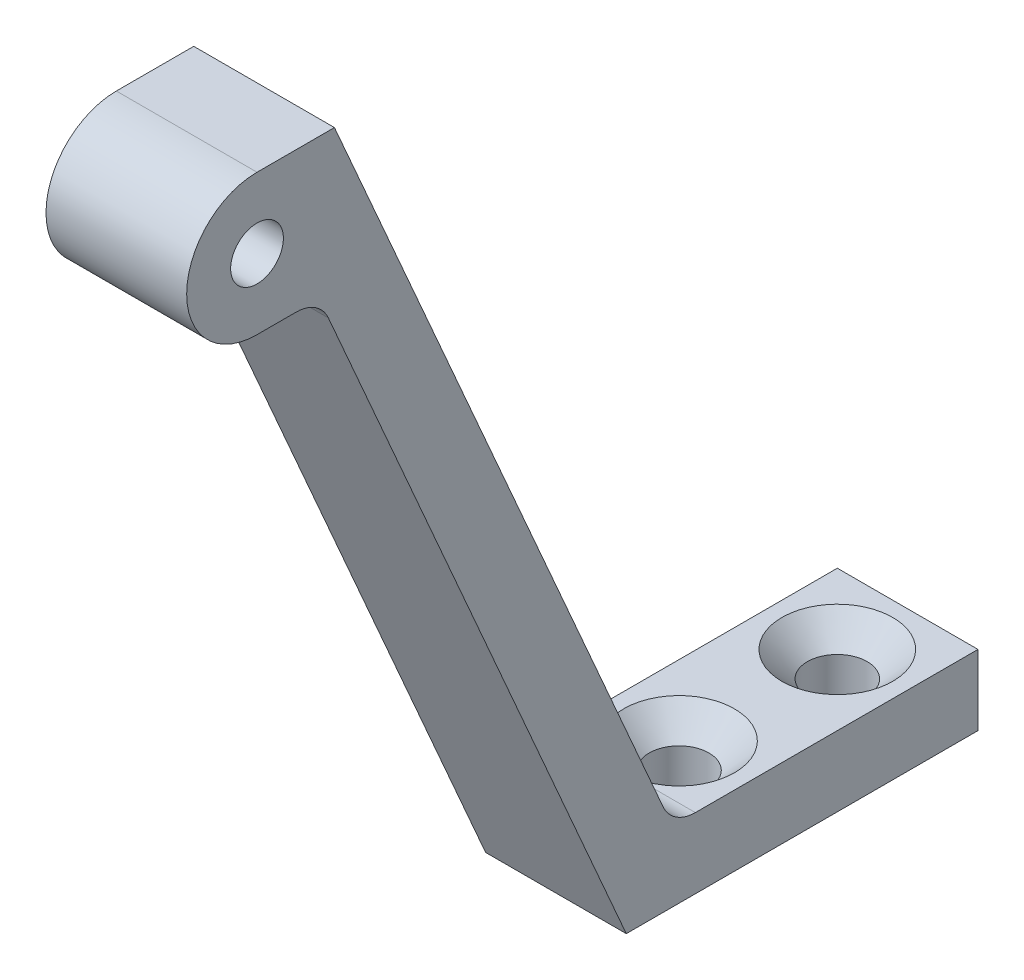
ISO-10303-21;
HEADER;
FILE_DESCRIPTION(('STEP AP214'),'2;1');
FILE_NAME('part.step','',(''),(''),'','','');
FILE_SCHEMA(('AUTOMOTIVE_DESIGN { 1 0 10303 214 1 1 1 1 }'));
ENDSEC;
DATA;
#1=APPLICATION_CONTEXT('core data for automotive mechanical design processes');
#2=APPLICATION_PROTOCOL_DEFINITION('international standard','automotive_design',2000,#1);
#3=PRODUCT_CONTEXT('',#1,'mechanical');
#4=PRODUCT('Part','Part','',(#3));
#5=PRODUCT_RELATED_PRODUCT_CATEGORY('part','',(#4));
#6=PRODUCT_DEFINITION_FORMATION('','',#4);
#7=PRODUCT_DEFINITION_CONTEXT('part definition',#1,'design');
#8=PRODUCT_DEFINITION('design','',#6,#7);
#9=PRODUCT_DEFINITION_SHAPE('','',#8);
#10=(LENGTH_UNIT() NAMED_UNIT(*) SI_UNIT(.MILLI.,.METRE.));
#11=(NAMED_UNIT(*) PLANE_ANGLE_UNIT() SI_UNIT($,.RADIAN.));
#12=(NAMED_UNIT(*) SI_UNIT($,.STERADIAN.) SOLID_ANGLE_UNIT());
#13=UNCERTAINTY_MEASURE_WITH_UNIT(LENGTH_MEASURE(1.E-05),#10,'distance_accuracy_value','');
#14=(GEOMETRIC_REPRESENTATION_CONTEXT(3) GLOBAL_UNCERTAINTY_ASSIGNED_CONTEXT((#13)) GLOBAL_UNIT_ASSIGNED_CONTEXT((#10,
#11,#12)) REPRESENTATION_CONTEXT('',''));
#15=CARTESIAN_POINT('',(0.,0.,0.));
#16=DIRECTION('',(0.,0.,1.));
#17=DIRECTION('',(1.,0.,0.));
#18=AXIS2_PLACEMENT_3D('',#15,#16,#17);
#19=CARTESIAN_POINT('',(4.,47.1171566627201,0.));
#20=DIRECTION('',(0.,-1.,0.));
#21=DIRECTION('',(0.,0.,-1.));
#22=AXIS2_PLACEMENT_3D('',#19,#20,#21);
#23=PLANE('',#22);
#24=DIRECTION('',(0.,0.,1.));
#25=VECTOR('',#24,1.);
#26=CARTESIAN_POINT('',(-4.,47.1171566627201,0.));
#27=LINE('',#26,#25);
#28=CARTESIAN_POINT('',(-4.,47.1171566627202,36.5978842547107));
#29=VERTEX_POINT('',#28);
#30=CARTESIAN_POINT('',(-4.,47.1171566627202,41.));
#31=VERTEX_POINT('',#30);
#32=EDGE_CURVE('E160',#29,#31,#27,.T.);
#33=ORIENTED_EDGE('',*,*,#32,.T.);
#34=DIRECTION('',(-1.,0.,0.));
#35=VECTOR('',#34,1.);
#36=CARTESIAN_POINT('',(4.,47.1171566627202,41.));
#37=LINE('',#36,#35);
#38=CARTESIAN_POINT('',(4.,47.1171566627202,41.));
#39=VERTEX_POINT('',#38);
#40=EDGE_CURVE('E140',#39,#31,#37,.T.);
#41=ORIENTED_EDGE('',*,*,#40,.F.);
#42=DIRECTION('',(0.,0.,1.));
#43=VECTOR('',#42,1.);
#44=CARTESIAN_POINT('',(4.,47.1171566627201,0.));
#45=LINE('',#44,#43);
#46=CARTESIAN_POINT('',(4.,47.1171566627202,36.5978842547107));
#47=VERTEX_POINT('',#46);
#48=EDGE_CURVE('E148',#47,#39,#45,.T.);
#49=ORIENTED_EDGE('',*,*,#48,.F.);
#50=DIRECTION('',(-1.,0.,0.));
#51=VECTOR('',#50,1.);
#52=CARTESIAN_POINT('',(4.,47.1171566627202,36.5978842547107));
#53=LINE('',#52,#51);
#54=EDGE_CURVE('E255',#47,#29,#53,.T.);
#55=ORIENTED_EDGE('',*,*,#54,.T.);
#56=EDGE_LOOP('',(#33,#41,#49,#55));
#57=FACE_BOUND('',#56,.T.);
#58=ADVANCED_FACE('F39',(#57),#23,.F.);
#59=CARTESIAN_POINT('',(4.,43.1171566627202,41.));
#60=DIRECTION('',(-1.,0.,0.));
#61=DIRECTION('',(0.,0.,1.));
#62=AXIS2_PLACEMENT_3D('',#59,#60,#61);
#63=CYLINDRICAL_SURFACE('',#62,4.);
#64=CARTESIAN_POINT('',(-4.,43.1171566627202,41.));
#65=DIRECTION('',(1.,0.,0.));
#66=DIRECTION('',(0.,0.,-1.));
#67=AXIS2_PLACEMENT_3D('',#64,#65,#66);
#68=CIRCLE('',#67,4.);
#69=CARTESIAN_POINT('',(-4.,39.1171566627202,41.));
#70=VERTEX_POINT('',#69);
#71=EDGE_CURVE('E282',#31,#70,#68,.T.);
#72=ORIENTED_EDGE('',*,*,#71,.T.);
#73=DIRECTION('',(-1.,0.,0.));
#74=VECTOR('',#73,1.);
#75=CARTESIAN_POINT('',(4.,39.1171566627202,41.));
#76=LINE('',#75,#74);
#77=CARTESIAN_POINT('',(4.,39.1171566627202,41.));
#78=VERTEX_POINT('',#77);
#79=EDGE_CURVE('E143',#78,#70,#76,.T.);
#80=ORIENTED_EDGE('',*,*,#79,.F.);
#81=CARTESIAN_POINT('',(4.,43.1171566627202,41.));
#82=DIRECTION('',(1.,0.,0.));
#83=DIRECTION('',(0.,0.,-1.));
#84=AXIS2_PLACEMENT_3D('',#81,#82,#83);
#85=CIRCLE('',#84,4.);
#86=EDGE_CURVE('E136',#39,#78,#85,.T.);
#87=ORIENTED_EDGE('',*,*,#86,.F.);
#88=ORIENTED_EDGE('',*,*,#40,.T.);
#89=EDGE_LOOP('',(#72,#80,#87,#88));
#90=FACE_BOUND('',#89,.T.);
#91=ADVANCED_FACE('F138',(#90),#63,.T.);
#92=CARTESIAN_POINT('',(4.,39.1171566627202,0.));
#93=DIRECTION('',(0.,1.,0.));
#94=DIRECTION('',(0.,0.,1.));
#95=AXIS2_PLACEMENT_3D('',#92,#93,#94);
#96=PLANE('',#95);
#97=DIRECTION('',(0.,0.,-1.));
#98=VECTOR('',#97,1.);
#99=CARTESIAN_POINT('',(-4.,39.1171566627202,0.));
#100=LINE('',#99,#98);
#101=CARTESIAN_POINT('',(-4.,39.1171566627202,38.777880849664));
#102=VERTEX_POINT('',#101);
#103=EDGE_CURVE('E277',#70,#102,#100,.T.);
#104=ORIENTED_EDGE('',*,*,#103,.T.);
#105=DIRECTION('',(-1.,0.,0.));
#106=VECTOR('',#105,1.);
#107=CARTESIAN_POINT('',(4.,39.1171566627202,38.777880849664));
#108=LINE('',#107,#106);
#109=CARTESIAN_POINT('',(4.,39.1171566627202,38.777880849664));
#110=VERTEX_POINT('',#109);
#111=EDGE_CURVE('E164',#102,#110,#108,.F.);
#112=ORIENTED_EDGE('',*,*,#111,.T.);
#113=DIRECTION('',(0.,0.,-1.));
#114=VECTOR('',#113,1.);
#115=CARTESIAN_POINT('',(4.,39.1171566627202,0.));
#116=LINE('',#115,#114);
#117=EDGE_CURVE('E147',#78,#110,#116,.T.);
#118=ORIENTED_EDGE('',*,*,#117,.F.);
#119=ORIENTED_EDGE('',*,*,#79,.T.);
#120=EDGE_LOOP('',(#104,#112,#118,#119));
#121=FACE_BOUND('',#120,.T.);
#122=ADVANCED_FACE('F317',(#121),#96,.F.);
#123=CARTESIAN_POINT('',(4.,-7.47681165129679,17.1202626975046));
#124=DIRECTION('',(0.,0.400221050026293,-0.916418633112537));
#125=DIRECTION('',(0.,0.916418633112537,0.400221050026293));
#126=AXIS2_PLACEMENT_3D('',#123,#124,#125);
#127=PLANE('',#126);
#128=DIRECTION('',(0.,-0.916418633112537,-0.400221050026293));
#129=VECTOR('',#128,1.);
#130=CARTESIAN_POINT('',(4.,-7.47681165129679,17.1202626975046));
#131=LINE('',#130,#129);
#132=CARTESIAN_POINT('',(4.,37.9175987627727,36.9450435834389));
#133=VERTEX_POINT('',#132);
#134=CARTESIAN_POINT('',(4.,-0.882843337279837,20.));
#135=VERTEX_POINT('',#134);
#136=EDGE_CURVE('E293',#133,#135,#131,.T.);
#137=ORIENTED_EDGE('',*,*,#136,.F.);
#138=DIRECTION('',(-1.,0.,0.));
#139=VECTOR('',#138,1.);
#140=CARTESIAN_POINT('',(-4.,37.9175987627727,36.9450435834389));
#141=LINE('',#140,#139);
#142=CARTESIAN_POINT('',(-4.,37.9175987627727,36.9450435834389));
#143=VERTEX_POINT('',#142);
#144=EDGE_CURVE('E161',#133,#143,#141,.T.);
#145=ORIENTED_EDGE('',*,*,#144,.T.);
#146=DIRECTION('',(0.,-0.916418633112537,-0.400221050026293));
#147=VECTOR('',#146,1.);
#148=CARTESIAN_POINT('',(-4.,-7.47681165129679,17.1202626975046));
#149=LINE('',#148,#147);
#150=CARTESIAN_POINT('',(-4.,-0.882843337279837,20.));
#151=VERTEX_POINT('',#150);
#152=EDGE_CURVE('E275',#143,#151,#149,.T.);
#153=ORIENTED_EDGE('',*,*,#152,.T.);
#154=DIRECTION('',(-1.,0.,0.));
#155=VECTOR('',#154,1.);
#156=CARTESIAN_POINT('',(4.,-0.882843337279837,20.));
#157=LINE('',#156,#155);
#158=EDGE_CURVE('E166',#135,#151,#157,.T.);
#159=ORIENTED_EDGE('',*,*,#158,.F.);
#160=EDGE_LOOP('',(#137,#145,#153,#159));
#161=FACE_BOUND('',#160,.T.);
#162=ADVANCED_FACE('F312',(#161),#127,.F.);
#163=CARTESIAN_POINT('',(4.,-0.882843337279837,0.));
#164=DIRECTION('',(0.,1.,0.));
#165=DIRECTION('',(0.,0.,1.));
#166=AXIS2_PLACEMENT_3D('',#163,#164,#165);
#167=PLANE('',#166);
#168=CARTESIAN_POINT('',(0.,-0.882843337279837,13.));
#169=DIRECTION('',(0.,1.,0.));
#170=DIRECTION('',(0.,0.,1.));
#171=AXIS2_PLACEMENT_3D('',#168,#169,#170);
#172=CIRCLE('',#171,1.7);
#173=CARTESIAN_POINT('',(0.,-0.882843337279837,14.7));
#174=VERTEX_POINT('',#173);
#175=EDGE_CURVE('E175',#174,#174,#172,.T.);
#176=ORIENTED_EDGE('',*,*,#175,.T.);
#177=EDGE_LOOP('',(#176));
#178=FACE_BOUND('',#177,.T.);
#179=CARTESIAN_POINT('',(0.,-0.882843337279838,4.));
#180=DIRECTION('',(0.,1.,0.));
#181=DIRECTION('',(0.,0.,1.));
#182=AXIS2_PLACEMENT_3D('',#179,#180,#181);
#183=CIRCLE('',#182,1.7);
#184=CARTESIAN_POINT('',(0.,-0.882843337279838,5.7));
#185=VERTEX_POINT('',#184);
#186=EDGE_CURVE('E170',#185,#185,#183,.T.);
#187=ORIENTED_EDGE('',*,*,#186,.T.);
#188=EDGE_LOOP('',(#187));
#189=FACE_BOUND('',#188,.T.);
#190=DIRECTION('',(0.,0.,-1.));
#191=VECTOR('',#190,1.);
#192=CARTESIAN_POINT('',(-4.,-0.882843337279837,0.));
#193=LINE('',#192,#191);
#194=CARTESIAN_POINT('',(-4.,-0.882843337279837,0.));
#195=VERTEX_POINT('',#194);
#196=EDGE_CURVE('E269',#151,#195,#193,.T.);
#197=ORIENTED_EDGE('',*,*,#196,.T.);
#198=DIRECTION('',(-1.,0.,0.));
#199=VECTOR('',#198,1.);
#200=CARTESIAN_POINT('',(4.,-0.882843337279837,0.));
#201=LINE('',#200,#199);
#202=CARTESIAN_POINT('',(4.,-0.882843337279837,0.));
#203=VERTEX_POINT('',#202);
#204=EDGE_CURVE('E260',#203,#195,#201,.T.);
#205=ORIENTED_EDGE('',*,*,#204,.F.);
#206=DIRECTION('',(0.,0.,-1.));
#207=VECTOR('',#206,1.);
#208=CARTESIAN_POINT('',(4.,-0.882843337279837,0.));
#209=LINE('',#208,#207);
#210=EDGE_CURVE('E270',#135,#203,#209,.T.);
#211=ORIENTED_EDGE('',*,*,#210,.F.);
#212=ORIENTED_EDGE('',*,*,#158,.T.);
#213=EDGE_LOOP('',(#197,#205,#211,#212));
#214=FACE_BOUND('',#213,.T.);
#215=ADVANCED_FACE('F267',(#178,#189,#214),#167,.F.);
#216=CARTESIAN_POINT('',(4.,0.,0.));
#217=DIRECTION('',(0.,0.,1.));
#218=DIRECTION('',(1.,0.,0.));
#219=AXIS2_PLACEMENT_3D('',#216,#217,#218);
#220=PLANE('',#219);
#221=DIRECTION('',(0.,1.,0.));
#222=VECTOR('',#221,1.);
#223=CARTESIAN_POINT('',(-4.,0.,0.));
#224=LINE('',#223,#222);
#225=CARTESIAN_POINT('',(-4.,3.11715666272016,0.));
#226=VERTEX_POINT('',#225);
#227=EDGE_CURVE('E251',#195,#226,#224,.T.);
#228=ORIENTED_EDGE('',*,*,#227,.T.);
#229=DIRECTION('',(-1.,0.,0.));
#230=VECTOR('',#229,1.);
#231=CARTESIAN_POINT('',(4.,3.11715666272016,0.));
#232=LINE('',#231,#230);
#233=CARTESIAN_POINT('',(4.,3.11715666272016,0.));
#234=VERTEX_POINT('',#233);
#235=EDGE_CURVE('E257',#234,#226,#232,.T.);
#236=ORIENTED_EDGE('',*,*,#235,.F.);
#237=DIRECTION('',(0.,1.,0.));
#238=VECTOR('',#237,1.);
#239=CARTESIAN_POINT('',(4.,0.,0.));
#240=LINE('',#239,#238);
#241=EDGE_CURVE('E290',#203,#234,#240,.T.);
#242=ORIENTED_EDGE('',*,*,#241,.F.);
#243=ORIENTED_EDGE('',*,*,#204,.T.);
#244=EDGE_LOOP('',(#228,#236,#242,#243));
#245=FACE_BOUND('',#244,.T.);
#246=ADVANCED_FACE('F309',(#245),#220,.F.);
#247=CARTESIAN_POINT('',(4.,3.11715666272016,0.));
#248=DIRECTION('',(0.,-1.,0.));
#249=DIRECTION('',(0.,0.,-1.));
#250=AXIS2_PLACEMENT_3D('',#247,#248,#249);
#251=PLANE('',#250);
#252=DIRECTION('',(0.,0.,1.));
#253=VECTOR('',#252,1.);
#254=CARTESIAN_POINT('',(-4.,3.11715666272016,0.));
#255=LINE('',#254,#253);
#256=CARTESIAN_POINT('',(-4.,3.11715666272016,16.0731116000777));
#257=VERTEX_POINT('',#256);
#258=EDGE_CURVE('E247',#226,#257,#255,.T.);
#259=ORIENTED_EDGE('',*,*,#258,.T.);
#260=DIRECTION('',(-1.,0.,0.));
#261=VECTOR('',#260,1.);
#262=CARTESIAN_POINT('',(4.,3.11715666272016,16.0731116000777));
#263=LINE('',#262,#261);
#264=CARTESIAN_POINT('',(-0.691726169425138,3.11715666272016,16.0731116000777));
#265=VERTEX_POINT('',#264);
#266=EDGE_CURVE('E232',#257,#265,#263,.F.);
#267=ORIENTED_EDGE('',*,*,#266,.T.);
#268=CARTESIAN_POINT('',(0.,3.11715666272016,13.));
#269=DIRECTION('',(0.,1.,0.));
#270=DIRECTION('',(0.,0.,1.));
#271=AXIS2_PLACEMENT_3D('',#268,#269,#270);
#272=CIRCLE('',#271,3.15);
#273=CARTESIAN_POINT('',(0.691726169425138,3.11715666272016,16.0731116000777));
#274=VERTEX_POINT('',#273);
#275=EDGE_CURVE('E302',#274,#265,#272,.T.);
#276=ORIENTED_EDGE('',*,*,#275,.F.);
#277=DIRECTION('',(-1.,0.,0.));
#278=VECTOR('',#277,1.);
#279=CARTESIAN_POINT('',(4.,3.11715666272016,16.0731116000777));
#280=LINE('',#279,#278);
#281=CARTESIAN_POINT('',(4.,3.11715666272016,16.0731116000777));
#282=VERTEX_POINT('',#281);
#283=EDGE_CURVE('E60',#274,#282,#280,.F.);
#284=ORIENTED_EDGE('',*,*,#283,.T.);
#285=DIRECTION('',(0.,0.,1.));
#286=VECTOR('',#285,1.);
#287=CARTESIAN_POINT('',(4.,3.11715666272016,0.));
#288=LINE('',#287,#286);
#289=EDGE_CURVE('E288',#234,#282,#288,.T.);
#290=ORIENTED_EDGE('',*,*,#289,.F.);
#291=ORIENTED_EDGE('',*,*,#235,.T.);
#292=EDGE_LOOP('',(#259,#267,#276,#284,#290,#291));
#293=FACE_BOUND('',#292,.T.);
#294=CARTESIAN_POINT('',(0.,3.11715666272016,4.));
#295=DIRECTION('',(0.,1.,0.));
#296=DIRECTION('',(0.,0.,1.));
#297=AXIS2_PLACEMENT_3D('',#294,#295,#296);
#298=CIRCLE('',#297,3.15);
#299=CARTESIAN_POINT('',(0.,3.11715666272016,7.15));
#300=VERTEX_POINT('',#299);
#301=EDGE_CURVE('E177',#300,#300,#298,.T.);
#302=ORIENTED_EDGE('',*,*,#301,.F.);
#303=EDGE_LOOP('',(#302));
#304=FACE_BOUND('',#303,.T.);
#305=ADVANCED_FACE('F213',(#293,#304),#251,.F.);
#306=CARTESIAN_POINT('',(4.,43.1171566627202,41.));
#307=DIRECTION('',(-1.,0.,0.));
#308=DIRECTION('',(0.,0.,1.));
#309=AXIS2_PLACEMENT_3D('',#306,#307,#308);
#310=CYLINDRICAL_SURFACE('',#309,1.5);
#311=CARTESIAN_POINT('',(4.,43.1171566627202,41.));
#312=DIRECTION('',(1.,0.,0.));
#313=DIRECTION('',(0.,0.,-1.));
#314=AXIS2_PLACEMENT_3D('',#311,#312,#313);
#315=CIRCLE('',#314,1.5);
#316=CARTESIAN_POINT('',(4.,43.1171566627202,39.5));
#317=VERTEX_POINT('',#316);
#318=EDGE_CURVE('E157',#317,#317,#315,.T.);
#319=ORIENTED_EDGE('',*,*,#318,.T.);
#320=EDGE_LOOP('',(#319));
#321=FACE_BOUND('',#320,.T.);
#322=CARTESIAN_POINT('',(-4.,43.1171566627202,41.));
#323=DIRECTION('',(1.,0.,0.));
#324=DIRECTION('',(0.,0.,-1.));
#325=AXIS2_PLACEMENT_3D('',#322,#323,#324);
#326=CIRCLE('',#325,1.5);
#327=CARTESIAN_POINT('',(-4.,43.1171566627202,39.5));
#328=VERTEX_POINT('',#327);
#329=EDGE_CURVE('E173',#328,#328,#326,.T.);
#330=ORIENTED_EDGE('',*,*,#329,.F.);
#331=EDGE_LOOP('',(#330));
#332=FACE_BOUND('',#331,.T.);
#333=ADVANCED_FACE('F200',(#321,#332),#310,.F.);
#334=CARTESIAN_POINT('',(4.,-5.87592745119162,13.4545881650545));
#335=DIRECTION('',(0.,-0.400221050026293,0.916418633112537));
#336=DIRECTION('',(0.,-0.916418633112537,-0.400221050026293));
#337=AXIS2_PLACEMENT_3D('',#334,#335,#336);
#338=PLANE('',#337);
#339=DIRECTION('',(0.,0.916418633112537,0.400221050026293));
#340=VECTOR('',#339,1.);
#341=CARTESIAN_POINT('',(4.,-5.87592745119162,13.4545881650545));
#342=LINE('',#341,#340);
#343=CARTESIAN_POINT('',(4.,4.31671456266757,17.9059488663028));
#344=VERTEX_POINT('',#343);
#345=EDGE_CURVE('E153',#344,#47,#342,.T.);
#346=ORIENTED_EDGE('',*,*,#345,.F.);
#347=DIRECTION('',(-1.,0.,0.));
#348=VECTOR('',#347,1.);
#349=CARTESIAN_POINT('',(-4.,4.31671456266757,17.9059488663028));
#350=LINE('',#349,#348);
#351=CARTESIAN_POINT('',(0.691726169425138,4.31671456266757,17.9059488663028));
#352=VERTEX_POINT('',#351);
#353=EDGE_CURVE('E190',#344,#352,#350,.T.);
#354=ORIENTED_EDGE('',*,*,#353,.T.);
#355=CARTESIAN_POINT('',(2.29732266590424,4.2084443010147,17.858664758102));
#356=CARTESIAN_POINT('',(1.9535060049704,2.65077168010552,17.1783933740293));
#357=CARTESIAN_POINT('',(1.90479997652415,3.11715666272016,15.5088318097142));
#358=CARTESIAN_POINT('',(2.21954004050003,4.22286919047016,17.8649644383963));
#359=CARTESIAN_POINT('',(1.9106842162015,2.68355066238594,17.1927087079095));
#360=CARTESIAN_POINT('',(1.86139155096025,3.11715666272016,15.5417787280839));
#361=CARTESIAN_POINT('',(2.14137252721431,4.23543194759832,17.8704508827651));
#362=CARTESIAN_POINT('',(1.8642024897097,2.71547729336588,17.2066518004143));
#363=CARTESIAN_POINT('',(1.81577593078527,3.11715666272016,15.5746454783185));
#364=CARTESIAN_POINT('',(1.98454582524431,4.25726183580689,17.8799844959688));
#365=CARTESIAN_POINT('',(1.76496880587652,2.77664971362105,17.2333672003228));
#366=CARTESIAN_POINT('',(1.71990695859288,3.11715666272016,15.639656630823));
#367=CARTESIAN_POINT('',(1.90588703607726,4.26653136025698,17.8840327100433));
#368=CARTESIAN_POINT('',(1.71227522741131,2.80594531118428,17.246161260149));
#369=CARTESIAN_POINT('',(1.66965700818528,3.11715666272016,15.6718015417103));
#370=CARTESIAN_POINT('',(1.74853602991008,4.28219388622008,17.8908728946058));
#371=CARTESIAN_POINT('',(1.601271625937,2.86139567902753,17.270377708441));
#372=CARTESIAN_POINT('',(1.56443022157713,3.11715666272016,15.7347389310682));
#373=CARTESIAN_POINT('',(1.66984503254052,4.28859749079044,17.8936694956924));
#374=CARTESIAN_POINT('',(1.5430162700462,2.88761364857371,17.2818276974768));
#375=CARTESIAN_POINT('',(1.50947172049492,3.11715666272016,15.7655360079103));
#376=CARTESIAN_POINT('',(1.51226789659236,4.29906203532993,17.898239602467));
#377=CARTESIAN_POINT('',(1.42126442265803,2.93675589356019,17.3032892437379));
#378=CARTESIAN_POINT('',(1.39451511734307,3.11715666272016,15.8252475190946));
#379=CARTESIAN_POINT('',(1.43338172375865,4.30312252969152,17.9000129135481));
#380=CARTESIAN_POINT('',(1.35777100359256,2.95973544651224,17.3133249419214));
#381=CARTESIAN_POINT('',(1.33451605915522,3.11715666272016,15.8541615944047));
#382=CARTESIAN_POINT('',(1.27568955404064,4.30940049868875,17.9027546466964));
#383=CARTESIAN_POINT('',(1.22627064865942,3.00214082443784,17.3318443437176));
#384=CARTESIAN_POINT('',(1.20962012511844,3.11715666272016,15.9092897245069));
#385=CARTESIAN_POINT('',(1.19688372558494,4.31162174397058,17.9037247154913));
#386=CARTESIAN_POINT('',(1.15824974339182,3.02162900085091,17.340355277635));
#387=CARTESIAN_POINT('',(1.1447335687559,3.11715666272016,15.9355092062849));
#388=CARTESIAN_POINT('',(1.03924018267895,4.3147524698598,17.9050919753412));
#389=CARTESIAN_POINT('',(1.01821903021099,3.05696501965281,17.3557873280513));
#390=CARTESIAN_POINT('',(1.01016609073526,3.11715666272016,15.9844914235514));
#391=CARTESIAN_POINT('',(0.960402466752246,4.31566188050052,17.9054891358401));
#392=CARTESIAN_POINT('',(0.946153011058534,3.07286517002013,17.362731288645));
#393=CARTESIAN_POINT('',(0.940484913563853,3.11715666272016,16.0072539746067));
#394=CARTESIAN_POINT('',(0.802652764235109,4.31667121404532,17.9059299349646));
#395=CARTESIAN_POINT('',(0.798690542554645,3.10094239489993,17.3749932571572));
#396=CARTESIAN_POINT('',(0.796750927108122,3.11715666272016,16.0484880635164));
#397=CARTESIAN_POINT('',(0.723740773914666,4.3167704167252,17.9059732590517));
#398=CARTESIAN_POINT('',(0.723202797448279,3.11316267594247,17.3803301343591));
#399=CARTESIAN_POINT('',(0.72269428718957,3.11715666272016,16.0669557693598));
#400=CARTESIAN_POINT('',(0.565917323226494,4.31660895105698,17.9059027432886));
#401=CARTESIAN_POINT('',(0.56977018402649,3.13380743142919,17.3893461729029));
#402=CARTESIAN_POINT('',(0.571060987559095,3.11715666272016,16.0987718672622));
#403=CARTESIAN_POINT('',(0.487005862868082,4.31634827982449,17.9057889021786));
#404=CARTESIAN_POINT('',(0.491707431419635,3.14226904625993,17.3930415543041));
#405=CARTESIAN_POINT('',(0.493484299638692,3.11715666272016,16.1121202182883));
#406=CARTESIAN_POINT('',(0.329428595514284,4.31582230861129,17.9055591984781));
#407=CARTESIAN_POINT('',(0.33427782571349,3.15535186142346,17.3987551199528));
#408=CARTESIAN_POINT('',(0.336163039026609,3.11715666272016,16.1330127163832));
#409=CARTESIAN_POINT('',(0.250762788474086,4.31555702556499,17.9054433432832));
#410=CARTESIAN_POINT('',(0.254775559198279,3.16000975660838,17.4007893296846));
#411=CARTESIAN_POINT('',(0.25642596632114,3.11715666272016,16.1405748016835));
#412=CARTESIAN_POINT('',(0.0934316455169184,4.31523229772396,17.9053015271821));
#413=CARTESIAN_POINT('',(0.0952031342719562,3.16552608565145,17.4031984371843));
#414=CARTESIAN_POINT('',(0.0958940746565963,3.11715666272016,16.1495659430668));
#415=CARTESIAN_POINT('',(0.0147663096091359,4.31517285000463,17.9052755649987));
#416=CARTESIAN_POINT('',(0.0149773758129747,3.16639543666174,17.4035781027232));
#417=CARTESIAN_POINT('',(0.0150992707425818,3.11715666272016,16.1509950862893));
#418=CARTESIAN_POINT('',(-0.142532823096386,4.31530070664325,17.9053314029272));
#419=CARTESIAN_POINT('',(-0.14501357170606,3.16434713770273,17.4026835635567));
#420=CARTESIAN_POINT('',(-0.146061671207776,3.11715666272016,16.1476435642628));
#421=CARTESIAN_POINT('',(-0.221166620010915,4.31548791300316,17.9054131602412));
#422=CARTESIAN_POINT('',(-0.224937294025596,3.16142693520827,17.4014082441051));
#423=CARTESIAN_POINT('',(-0.226427966759686,3.11715666272016,16.1428653652612));
#424=CARTESIAN_POINT('',(-0.378433803602005,4.31597338674829,17.905625177768));
#425=CARTESIAN_POINT('',(-0.383387636422255,3.15182705216847,17.3972157548524));
#426=CARTESIAN_POINT('',(-0.385355107640996,3.11715666272016,16.1273596283005));
#427=CARTESIAN_POINT('',(-0.457067190277353,4.31627165436766,17.905755438083));
#428=CARTESIAN_POINT('',(-0.462063029959039,3.14512876253822,17.3942904580368));
#429=CARTESIAN_POINT('',(-0.463915949163399,3.11715666272016,16.1166320777976));
#430=CARTESIAN_POINT('',(-0.614423045198947,4.31668804287745,17.9059372845018));
#431=CARTESIAN_POINT('',(-0.617208194108545,3.12800228876796,17.3868109338675));
#432=CARTESIAN_POINT('',(-0.618098977265157,3.11715666272016,16.0897552541455));
#433=CARTESIAN_POINT('',(-0.693145514562385,4.31680596159524,17.9059887823123));
#434=CARTESIAN_POINT('',(-0.693803990400051,3.11753831167058,17.3822410749078));
#435=CARTESIAN_POINT('',(-0.693717773415889,3.11715666272016,16.0735999211039));
#436=CARTESIAN_POINT('',(-0.850584002101797,4.31645154566751,17.9058340007423));
#437=CARTESIAN_POINT('',(-0.843897917515638,3.09294320076033,17.3714998254849));
#438=CARTESIAN_POINT('',(-0.840985525832642,3.11715666272016,16.0366116777512));
#439=CARTESIAN_POINT('',(-0.929300020328496,4.31597925419165,17.9056277402151));
#440=CARTESIAN_POINT('',(-0.917497861275478,3.07877011108031,17.3653101119317));
#441=CARTESIAN_POINT('',(-0.912634772042617,3.11715666272016,16.015779109638));
#442=CARTESIAN_POINT('',(-1.08676477908502,4.31396296496035,17.9047471804315));
#443=CARTESIAN_POINT('',(-1.06093766105673,3.04683263206277,17.3513622818399));
#444=CARTESIAN_POINT('',(-1.05137372921134,3.11715666272016,15.9702605335739));
#445=CARTESIAN_POINT('',(-1.16551351282099,4.31241835892219,17.904072615524));
#446=CARTESIAN_POINT('',(-1.13084550282504,3.02901640732196,17.3435815275911));
#447=CARTESIAN_POINT('',(-1.11846082851241,3.11715666272016,15.9455723446417));
#448=CARTESIAN_POINT('',(-1.32297412652438,4.30774380813714,17.9020311319094));
#449=CARTESIAN_POINT('',(-1.26631297387371,2.98993264067077,17.3265127496735));
#450=CARTESIAN_POINT('',(-1.24776631945386,3.11715666272016,15.8931748747638));
#451=CARTESIAN_POINT('',(-1.40168599083736,4.30461343619772,17.9006640266376));
#452=CARTESIAN_POINT('',(-1.33191081689578,2.96860990195502,17.317200620293));
#453=CARTESIAN_POINT('',(-1.30998339393186,3.11715666272016,15.8654647813207));
#454=CARTESIAN_POINT('',(-1.48034573783762,4.30043389637565,17.8988387256716));
#455=CARTESIAN_POINT('',(-1.39463271119733,2.94574865897813,17.3072165907911));
#456=CARTESIAN_POINT('',(-1.36961497079851,3.11715666272016,15.8366626221256));
#457=(BOUNDED_SURFACE() B_SPLINE_SURFACE(3,2,((#355,#356,#357),(#358,#359,#360),(#361,#362,
#363),(#364,#365,#366),(#367,#368,#369),(#370,#371,#372),(#373,#374,#375),(#376,#377,#378),
(#379,#380,#381),(#382,#383,#384),(#385,#386,#387),(#388,#389,#390),(#391,#392,#393),(#394,#395,
#396),(#397,#398,#399),(#400,#401,#402),(#403,#404,#405),(#406,#407,#408),(#409,#410,#411),
(#412,#413,#414),(#415,#416,#417),(#418,#419,#420),(#421,#422,#423),(#424,#425,#426),(#427,#428,
#429),(#430,#431,#432),(#433,#434,#435),(#436,#437,#438),(#439,#440,#441),(#442,#443,#444),
(#445,#446,#447),(#448,#449,#450),(#451,#452,#453),(#454,#455,#456)),.UNSPECIFIED.,.F.,.F.,
.F.) B_SPLINE_SURFACE_WITH_KNOTS((4,2,2,2,2,2,2,2,2,2,2,2,2,2,2,2,4),(3,3),(0.,
0.238013862963418,0.475854392865256,0.712807557931939,0.949805771391291,1.18631690314246,
1.42284064874094,1.65957462629571,1.89631050129205,2.13230945473585,2.36830505499408,
2.6042069201938,2.84010928277272,3.07627590056045,3.31242524545673,3.5487086583487,
3.78505575795919),(0.,1.),
.UNSPECIFIED.) GEOMETRIC_REPRESENTATION_ITEM() RATIONAL_B_SPLINE_SURFACE(((1.,0.755533848658442,
1.),(1.,0.760530030391084,1.),(1.,0.765462820473667,1.),(1.,0.775130303732044,1.),(1.,
0.779865138555386,1.),(1.,0.789055695197257,1.),(1.,0.793512392457161,1.),(1.,0.802086074269951,
1.),(1.,0.806202994077215,1.),(1.,0.813998369319614,1.),(1.,0.817677708502787,1.),(1.,
0.824511321639143,1.),(1.,0.827665567578559,1.),(1.,0.833353031849889,1.),(1.,0.835885695695151,
1.),(1.,0.840234590726424,1.),(1.,0.842050816170007,1.),(1.,0.844888264165405,1.),(1.,
0.845911943837365,1.),(1.,0.847128652186642,1.),(1.,0.847321692666038,1.),(1.,0.846868461778088,
1.),(1.,0.84622252374644,1.),(1.,0.84412089610536,1.),(1.,0.842665204788638,1.),(1.,
0.839003569285795,1.),(1.,0.83679678650137,1.),(1.,0.831717896930548,1.),(1.,0.82884583881681,
1.),(1.,0.822530708739588,1.),(1.,0.819087313522702,1.),(1.,0.811726514339631,1.),(1.,
0.807808982861519,1.),(1.,0.803703280271525,1.))) REPRESENTATION_ITEM('') SURFACE());
#458=CARTESIAN_POINT('',(2.29732266590424,4.2084443010147,17.858664758102));
#459=CARTESIAN_POINT('',(2.21954004050003,4.22286919047016,17.8649644383963));
#460=CARTESIAN_POINT('',(2.14137252721431,4.23543194759832,17.8704508827651));
#461=CARTESIAN_POINT('',(1.98454582524431,4.25726183580689,17.8799844959688));
#462=CARTESIAN_POINT('',(1.90588703607726,4.26653136025698,17.8840327100433));
#463=CARTESIAN_POINT('',(1.74853602991008,4.28219388622008,17.8908728946058));
#464=CARTESIAN_POINT('',(1.66984503254052,4.28859749079044,17.8936694956924));
#465=CARTESIAN_POINT('',(1.51226789659236,4.29906203532993,17.898239602467));
#466=CARTESIAN_POINT('',(1.43338172375865,4.30312252969152,17.9000129135481));
#467=CARTESIAN_POINT('',(1.27568955404064,4.30940049868875,17.9027546466964));
#468=CARTESIAN_POINT('',(1.19688372558494,4.31162174397058,17.9037247154913));
#469=CARTESIAN_POINT('',(1.03924018267895,4.3147524698598,17.9050919753412));
#470=CARTESIAN_POINT('',(0.960402466752246,4.31566188050052,17.9054891358401));
#471=CARTESIAN_POINT('',(0.802652764235109,4.31667121404532,17.9059299349646));
#472=CARTESIAN_POINT('',(0.723740773914666,4.3167704167252,17.9059732590517));
#473=CARTESIAN_POINT('',(0.565917323226494,4.31660895105698,17.9059027432886));
#474=CARTESIAN_POINT('',(0.487005862868082,4.31634827982449,17.9057889021786));
#475=CARTESIAN_POINT('',(0.329428595514284,4.31582230861129,17.9055591984781));
#476=CARTESIAN_POINT('',(0.250762788474086,4.31555702556499,17.9054433432832));
#477=CARTESIAN_POINT('',(0.0934316455169183,4.31523229772396,17.9053015271821));
#478=CARTESIAN_POINT('',(0.0147663096091357,4.31517285000463,17.9052755649987));
#479=CARTESIAN_POINT('',(-0.142532823096386,4.31530070664325,17.9053314029272));
#480=CARTESIAN_POINT('',(-0.221166620010914,4.31548791300316,17.9054131602412));
#481=CARTESIAN_POINT('',(-0.378433803602005,4.31597338674829,17.905625177768));
#482=CARTESIAN_POINT('',(-0.457067190277353,4.31627165436766,17.905755438083));
#483=CARTESIAN_POINT('',(-0.614423045198947,4.31668804287745,17.9059372845018));
#484=CARTESIAN_POINT('',(-0.693145514562385,4.31680596159524,17.9059887823123));
#485=CARTESIAN_POINT('',(-0.850584002101797,4.31645154566751,17.9058340007423));
#486=CARTESIAN_POINT('',(-0.929300020328496,4.31597925419165,17.9056277402151));
#487=CARTESIAN_POINT('',(-1.08676477908502,4.31396296496035,17.9047471804315));
#488=CARTESIAN_POINT('',(-1.16551351282099,4.31241835892219,17.904072615524));
#489=CARTESIAN_POINT('',(-1.32297412652438,4.30774380813714,17.9020311319094));
#490=CARTESIAN_POINT('',(-1.40168599083736,4.30461343619772,17.9006640266375));
#491=CARTESIAN_POINT('',(-1.48034573783762,4.30043389637565,17.8988387256716));
#492=B_SPLINE_CURVE_WITH_KNOTS('',3,(#458,#459,#460,#461,#462,#463,#464,#465,#466,#467,#468,
#469,#470,#471,#472,#473,#474,#475,#476,#477,#478,#479,#480,#481,#482,#483,#484,#485,#486,#487,
#488,#489,#490,#491),.UNSPECIFIED.,.F.,.F.,(4,2,2,2,2,2,2,2,2,2,2,2,2,2,2,2,4),(0.,
0.238013862963418,0.475854392865256,0.712807557931939,0.949805771391291,1.18631690314246,
1.42284064874094,1.65957462629571,1.89631050129205,2.13230945473585,2.36830505499408,
2.6042069201938,2.84010928277272,3.07627590056045,3.31242524545673,3.5487086583487,
3.78505575795919),.UNSPECIFIED.);
#493=CARTESIAN_POINT('',(-0.691726169425138,4.31671456266757,17.9059488663028));
#494=VERTEX_POINT('',#493);
#495=EDGE_CURVE('E183',#352,#494,#492,.T.);
#496=ORIENTED_EDGE('',*,*,#495,.T.);
#497=DIRECTION('',(-1.,0.,0.));
#498=VECTOR('',#497,1.);
#499=CARTESIAN_POINT('',(-4.,4.31671456266757,17.9059488663028));
#500=LINE('',#499,#498);
#501=CARTESIAN_POINT('',(-4.,4.31671456266757,17.9059488663028));
#502=VERTEX_POINT('',#501);
#503=EDGE_CURVE('E181',#494,#502,#500,.T.);
#504=ORIENTED_EDGE('',*,*,#503,.T.);
#505=DIRECTION('',(0.,0.916418633112537,0.400221050026293));
#506=VECTOR('',#505,1.);
#507=CARTESIAN_POINT('',(-4.,-5.87592745119162,13.4545881650545));
#508=LINE('',#507,#506);
#509=EDGE_CURVE('E245',#502,#29,#508,.T.);
#510=ORIENTED_EDGE('',*,*,#509,.T.);
#511=ORIENTED_EDGE('',*,*,#54,.F.);
#512=EDGE_LOOP('',(#346,#354,#496,#504,#510,#511));
#513=FACE_BOUND('',#512,.T.);
#514=ADVANCED_FACE('F192',(#513),#338,.F.);
#515=CARTESIAN_POINT('',(4.,0.,0.));
#516=DIRECTION('',(1.,0.,0.));
#517=DIRECTION('',(0.,0.,-1.));
#518=AXIS2_PLACEMENT_3D('',#515,#516,#517);
#519=PLANE('',#518);
#520=ORIENTED_EDGE('',*,*,#318,.F.);
#521=EDGE_LOOP('',(#520));
#522=FACE_BOUND('',#521,.T.);
#523=ORIENTED_EDGE('',*,*,#48,.T.);
#524=ORIENTED_EDGE('',*,*,#86,.T.);
#525=ORIENTED_EDGE('',*,*,#117,.T.);
#526=CARTESIAN_POINT('',(4.,37.1171566627202,38.777880849664));
#527=DIRECTION('',(1.,0.,0.));
#528=DIRECTION('',(0.,0.,-1.));
#529=AXIS2_PLACEMENT_3D('',#526,#527,#528);
#530=CIRCLE('',#529,2.);
#531=EDGE_CURVE('E228',#110,#133,#530,.F.);
#532=ORIENTED_EDGE('',*,*,#531,.T.);
#533=ORIENTED_EDGE('',*,*,#136,.T.);
#534=ORIENTED_EDGE('',*,*,#210,.T.);
#535=ORIENTED_EDGE('',*,*,#241,.T.);
#536=ORIENTED_EDGE('',*,*,#289,.T.);
#537=CARTESIAN_POINT('',(4.,5.11715666272016,16.0731116000777));
#538=DIRECTION('',(1.,0.,0.));
#539=DIRECTION('',(0.,0.,-1.));
#540=AXIS2_PLACEMENT_3D('',#537,#538,#539);
#541=CIRCLE('',#540,2.);
#542=EDGE_CURVE('E11',#282,#344,#541,.F.);
#543=ORIENTED_EDGE('',*,*,#542,.T.);
#544=ORIENTED_EDGE('',*,*,#345,.T.);
#545=EDGE_LOOP('',(#523,#524,#525,#532,#533,#534,#535,#536,#543,#544));
#546=FACE_BOUND('',#545,.T.);
#547=ADVANCED_FACE('F151',(#522,#546),#519,.T.);
#548=CARTESIAN_POINT('',(-4.,0.,0.));
#549=DIRECTION('',(1.,0.,0.));
#550=DIRECTION('',(0.,0.,-1.));
#551=AXIS2_PLACEMENT_3D('',#548,#549,#550);
#552=PLANE('',#551);
#553=ORIENTED_EDGE('',*,*,#329,.T.);
#554=EDGE_LOOP('',(#553));
#555=FACE_BOUND('',#554,.T.);
#556=ORIENTED_EDGE('',*,*,#32,.F.);
#557=ORIENTED_EDGE('',*,*,#509,.F.);
#558=CARTESIAN_POINT('',(-4.,5.11715666272016,16.0731116000777));
#559=DIRECTION('',(1.,0.,0.));
#560=DIRECTION('',(0.,0.,-1.));
#561=AXIS2_PLACEMENT_3D('',#558,#559,#560);
#562=CIRCLE('',#561,2.);
#563=EDGE_CURVE('E52',#502,#257,#562,.T.);
#564=ORIENTED_EDGE('',*,*,#563,.T.);
#565=ORIENTED_EDGE('',*,*,#258,.F.);
#566=ORIENTED_EDGE('',*,*,#227,.F.);
#567=ORIENTED_EDGE('',*,*,#196,.F.);
#568=ORIENTED_EDGE('',*,*,#152,.F.);
#569=CARTESIAN_POINT('',(-4.,37.1171566627202,38.777880849664));
#570=DIRECTION('',(1.,0.,0.));
#571=DIRECTION('',(0.,0.,-1.));
#572=AXIS2_PLACEMENT_3D('',#569,#570,#571);
#573=CIRCLE('',#572,2.);
#574=EDGE_CURVE('E230',#143,#102,#573,.T.);
#575=ORIENTED_EDGE('',*,*,#574,.T.);
#576=ORIENTED_EDGE('',*,*,#103,.F.);
#577=ORIENTED_EDGE('',*,*,#71,.F.);
#578=EDGE_LOOP('',(#556,#557,#564,#565,#566,#567,#568,#575,#576,#577));
#579=FACE_BOUND('',#578,.T.);
#580=ADVANCED_FACE('F246',(#555,#579),#552,.F.);
#581=CARTESIAN_POINT('',(0.,3.11715666272016,4.));
#582=DIRECTION('',(0.,1.,0.));
#583=DIRECTION('',(0.,0.,1.));
#584=AXIS2_PLACEMENT_3D('',#581,#582,#583);
#585=CYLINDRICAL_SURFACE('',#584,1.7);
#586=CARTESIAN_POINT('',(0.,1.66715666272016,4.));
#587=DIRECTION('',(0.,1.,0.));
#588=DIRECTION('',(0.,0.,1.));
#589=AXIS2_PLACEMENT_3D('',#586,#587,#588);
#590=CIRCLE('',#589,1.7);
#591=CARTESIAN_POINT('',(0.,1.66715666272016,5.7));
#592=VERTEX_POINT('',#591);
#593=EDGE_CURVE('E174',#592,#592,#590,.T.);
#594=ORIENTED_EDGE('',*,*,#593,.T.);
#595=EDGE_LOOP('',(#594));
#596=FACE_BOUND('',#595,.T.);
#597=ORIENTED_EDGE('',*,*,#186,.F.);
#598=EDGE_LOOP('',(#597));
#599=FACE_BOUND('',#598,.T.);
#600=ADVANCED_FACE('F393',(#596,#599),#585,.F.);
#601=CARTESIAN_POINT('',(0.,3.11715666272016,4.));
#602=DIRECTION('',(0.,1.,0.));
#603=DIRECTION('',(0.,0.,1.));
#604=AXIS2_PLACEMENT_3D('',#601,#602,#603);
#605=CONICAL_SURFACE('',#604,3.15,0.785398163397449);
#606=ORIENTED_EDGE('',*,*,#593,.F.);
#607=EDGE_LOOP('',(#606));
#608=FACE_BOUND('',#607,.T.);
#609=ORIENTED_EDGE('',*,*,#301,.T.);
#610=EDGE_LOOP('',(#609));
#611=FACE_BOUND('',#610,.T.);
#612=ADVANCED_FACE('F402',(#608,#611),#605,.F.);
#613=CARTESIAN_POINT('',(0.,3.11715666272016,13.));
#614=DIRECTION('',(0.,1.,0.));
#615=DIRECTION('',(0.,0.,1.));
#616=AXIS2_PLACEMENT_3D('',#613,#614,#615);
#617=CYLINDRICAL_SURFACE('',#616,1.7);
#618=CARTESIAN_POINT('',(0.,1.66715666272016,13.));
#619=DIRECTION('',(0.,1.,0.));
#620=DIRECTION('',(0.,0.,1.));
#621=AXIS2_PLACEMENT_3D('',#618,#619,#620);
#622=CIRCLE('',#621,1.7);
#623=CARTESIAN_POINT('',(0.,1.66715666272016,14.7));
#624=VERTEX_POINT('',#623);
#625=EDGE_CURVE('E178',#624,#624,#622,.T.);
#626=ORIENTED_EDGE('',*,*,#625,.T.);
#627=EDGE_LOOP('',(#626));
#628=FACE_BOUND('',#627,.T.);
#629=ORIENTED_EDGE('',*,*,#175,.F.);
#630=EDGE_LOOP('',(#629));
#631=FACE_BOUND('',#630,.T.);
#632=ADVANCED_FACE('F409',(#628,#631),#617,.F.);
#633=CARTESIAN_POINT('',(0.,3.11715666272016,13.));
#634=DIRECTION('',(0.,1.,0.));
#635=DIRECTION('',(0.,0.,1.));
#636=AXIS2_PLACEMENT_3D('',#633,#634,#635);
#637=CONICAL_SURFACE('',#636,3.15,0.785398163397449);
#638=ORIENTED_EDGE('',*,*,#625,.F.);
#639=EDGE_LOOP('',(#638));
#640=FACE_BOUND('',#639,.T.);
#641=ORIENTED_EDGE('',*,*,#275,.T.);
#642=EDGE_CURVE('E224',#265,#274,#272,.T.);
#643=ORIENTED_EDGE('',*,*,#642,.T.);
#644=EDGE_LOOP('',(#641,#643));
#645=FACE_BOUND('',#644,.T.);
#646=ADVANCED_FACE('F216',(#640,#645),#637,.F.);
#647=CARTESIAN_POINT('',(4.,37.1171566627202,38.777880849664));
#648=DIRECTION('',(1.,0.,0.));
#649=DIRECTION('',(0.,0.,-1.));
#650=AXIS2_PLACEMENT_3D('',#647,#648,#649);
#651=CYLINDRICAL_SURFACE('',#650,2.);
#652=ORIENTED_EDGE('',*,*,#531,.F.);
#653=ORIENTED_EDGE('',*,*,#111,.F.);
#654=ORIENTED_EDGE('',*,*,#574,.F.);
#655=ORIENTED_EDGE('',*,*,#144,.F.);
#656=EDGE_LOOP('',(#652,#653,#654,#655));
#657=FACE_BOUND('',#656,.T.);
#658=ADVANCED_FACE('F202',(#657),#651,.F.);
#659=CARTESIAN_POINT('',(4.,5.11715666272016,16.0731116000777));
#660=DIRECTION('',(1.,0.,0.));
#661=DIRECTION('',(0.,0.,-1.));
#662=AXIS2_PLACEMENT_3D('',#659,#660,#661);
#663=CYLINDRICAL_SURFACE('',#662,2.);
#664=ORIENTED_EDGE('',*,*,#563,.F.);
#665=ORIENTED_EDGE('',*,*,#503,.F.);
#666=CARTESIAN_POINT('',(-0.691726169425138,5.11715666272016,16.0731116000777));
#667=DIRECTION('',(-1.,0.,0.));
#668=DIRECTION('',(0.,0.,1.));
#669=AXIS2_PLACEMENT_3D('',#666,#667,#668);
#670=CIRCLE('',#669,2.);
#671=EDGE_CURVE('E221',#265,#494,#670,.T.);
#672=ORIENTED_EDGE('',*,*,#671,.F.);
#673=ORIENTED_EDGE('',*,*,#266,.F.);
#674=EDGE_LOOP('',(#664,#665,#672,#673));
#675=FACE_BOUND('',#674,.T.);
#676=ADVANCED_FACE('F41',(#675),#663,.F.);
#677=ORIENTED_EDGE('',*,*,#671,.T.);
#678=ORIENTED_EDGE('',*,*,#495,.F.);
#679=CARTESIAN_POINT('',(0.691726169425123,5.11715666272016,16.0731116000777));
#680=DIRECTION('',(1.,0.,0.));
#681=DIRECTION('',(0.,1.,0.));
#682=AXIS2_PLACEMENT_3D('',#679,#680,#681);
#683=CIRCLE('',#682,2.);
#684=EDGE_CURVE('E225',#274,#352,#683,.F.);
#685=ORIENTED_EDGE('',*,*,#684,.F.);
#686=ORIENTED_EDGE('',*,*,#642,.F.);
#687=EDGE_LOOP('',(#677,#678,#685,#686));
#688=FACE_BOUND('',#687,.T.);
#689=ADVANCED_FACE('F204',(#688),#457,.F.);
#690=CARTESIAN_POINT('',(4.,5.11715666272016,16.0731116000777));
#691=DIRECTION('',(1.,0.,0.));
#692=DIRECTION('',(0.,0.,-1.));
#693=AXIS2_PLACEMENT_3D('',#690,#691,#692);
#694=CYLINDRICAL_SURFACE('',#693,2.);
#695=ORIENTED_EDGE('',*,*,#542,.F.);
#696=ORIENTED_EDGE('',*,*,#283,.F.);
#697=ORIENTED_EDGE('',*,*,#684,.T.);
#698=ORIENTED_EDGE('',*,*,#353,.F.);
#699=EDGE_LOOP('',(#695,#696,#697,#698));
#700=FACE_BOUND('',#699,.T.);
#701=ADVANCED_FACE('F208',(#700),#694,.F.);
#702=CLOSED_SHELL('',(#58,#91,#122,#162,#215,#246,#305,#333,#514,#547,#580,#600,#612,#632,#646,
#658,#676,#689,#701));
#703=MANIFOLD_SOLID_BREP('B2',#702);
#704=ADVANCED_BREP_SHAPE_REPRESENTATION('',(#18,#703),#14);
#705=SHAPE_DEFINITION_REPRESENTATION(#9,#704);
ENDSEC;
END-ISO-10303-21;
